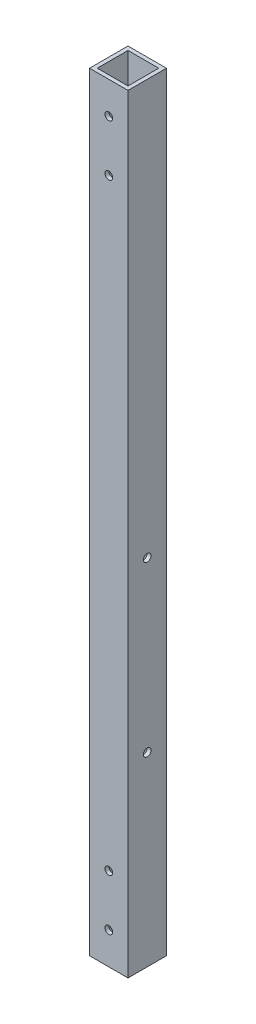
ISO-10303-21;
HEADER;
FILE_DESCRIPTION(('STEP AP214'),'2;1');
FILE_NAME('part.step','',(''),(''),'','','');
FILE_SCHEMA(('AUTOMOTIVE_DESIGN { 1 0 10303 214 1 1 1 1 }'));
ENDSEC;
DATA;
#1=APPLICATION_CONTEXT('core data for automotive mechanical design processes');
#2=APPLICATION_PROTOCOL_DEFINITION('international standard','automotive_design',2000,#1);
#3=PRODUCT_CONTEXT('',#1,'mechanical');
#4=PRODUCT('Part','Part','',(#3));
#5=PRODUCT_RELATED_PRODUCT_CATEGORY('part','',(#4));
#6=PRODUCT_DEFINITION_FORMATION('','',#4);
#7=PRODUCT_DEFINITION_CONTEXT('part definition',#1,'design');
#8=PRODUCT_DEFINITION('design','',#6,#7);
#9=PRODUCT_DEFINITION_SHAPE('','',#8);
#10=(LENGTH_UNIT() NAMED_UNIT(*) SI_UNIT(.MILLI.,.METRE.));
#11=(NAMED_UNIT(*) PLANE_ANGLE_UNIT() SI_UNIT($,.RADIAN.));
#12=(NAMED_UNIT(*) SI_UNIT($,.STERADIAN.) SOLID_ANGLE_UNIT());
#13=UNCERTAINTY_MEASURE_WITH_UNIT(LENGTH_MEASURE(1.E-05),#10,'distance_accuracy_value','');
#14=(GEOMETRIC_REPRESENTATION_CONTEXT(3) GLOBAL_UNCERTAINTY_ASSIGNED_CONTEXT((#13)) GLOBAL_UNIT_ASSIGNED_CONTEXT((#10,
#11,#12)) REPRESENTATION_CONTEXT('',''));
#15=CARTESIAN_POINT('',(0.,0.,0.));
#16=DIRECTION('',(0.,0.,1.));
#17=DIRECTION('',(1.,0.,0.));
#18=AXIS2_PLACEMENT_3D('',#15,#16,#17);
#19=CARTESIAN_POINT('',(0.,300.,0.));
#20=DIRECTION('',(0.,1.,0.));
#21=DIRECTION('',(0.,0.,1.));
#22=AXIS2_PLACEMENT_3D('',#19,#20,#21);
#23=PLANE('',#22);
#24=DIRECTION('',(0.,0.,1.));
#25=VECTOR('',#24,1.);
#26=CARTESIAN_POINT('',(0.,300.,0.));
#27=LINE('',#26,#25);
#28=CARTESIAN_POINT('',(0.,300.,-15.));
#29=VERTEX_POINT('',#28);
#30=CARTESIAN_POINT('',(0.,300.,0.));
#31=VERTEX_POINT('',#30);
#32=EDGE_CURVE('E170',#29,#31,#27,.T.);
#33=ORIENTED_EDGE('',*,*,#32,.T.);
#34=DIRECTION('',(1.,0.,0.));
#35=VECTOR('',#34,1.);
#36=CARTESIAN_POINT('',(0.,300.,0.));
#37=LINE('',#36,#35);
#38=CARTESIAN_POINT('',(15.,300.,0.));
#39=VERTEX_POINT('',#38);
#40=EDGE_CURVE('E173',#31,#39,#37,.T.);
#41=ORIENTED_EDGE('',*,*,#40,.T.);
#42=DIRECTION('',(0.,0.,-1.));
#43=VECTOR('',#42,1.);
#44=CARTESIAN_POINT('',(15.,300.,0.));
#45=LINE('',#44,#43);
#46=CARTESIAN_POINT('',(15.,300.,-15.));
#47=VERTEX_POINT('',#46);
#48=EDGE_CURVE('E176',#39,#47,#45,.T.);
#49=ORIENTED_EDGE('',*,*,#48,.T.);
#50=DIRECTION('',(-1.,0.,0.));
#51=VECTOR('',#50,1.);
#52=CARTESIAN_POINT('',(0.,300.,-15.));
#53=LINE('',#52,#51);
#54=EDGE_CURVE('E178',#47,#29,#53,.T.);
#55=ORIENTED_EDGE('',*,*,#54,.T.);
#56=EDGE_LOOP('',(#33,#41,#49,#55));
#57=FACE_BOUND('',#56,.T.);
#58=DIRECTION('',(1.,0.,0.));
#59=VECTOR('',#58,1.);
#60=CARTESIAN_POINT('',(0.,300.,-1.5));
#61=LINE('',#60,#59);
#62=CARTESIAN_POINT('',(1.5,300.,-1.5));
#63=VERTEX_POINT('',#62);
#64=CARTESIAN_POINT('',(13.5,300.,-1.5));
#65=VERTEX_POINT('',#64);
#66=EDGE_CURVE('E140',#63,#65,#61,.T.);
#67=ORIENTED_EDGE('',*,*,#66,.F.);
#68=DIRECTION('',(0.,0.,1.));
#69=VECTOR('',#68,1.);
#70=CARTESIAN_POINT('',(1.5,300.,0.));
#71=LINE('',#70,#69);
#72=CARTESIAN_POINT('',(1.5,300.,-13.5));
#73=VERTEX_POINT('',#72);
#74=EDGE_CURVE('E132',#73,#63,#71,.T.);
#75=ORIENTED_EDGE('',*,*,#74,.F.);
#76=DIRECTION('',(-1.,0.,0.));
#77=VECTOR('',#76,1.);
#78=CARTESIAN_POINT('',(0.,300.,-13.5));
#79=LINE('',#78,#77);
#80=CARTESIAN_POINT('',(13.5,300.,-13.5));
#81=VERTEX_POINT('',#80);
#82=EDGE_CURVE('E154',#81,#73,#79,.T.);
#83=ORIENTED_EDGE('',*,*,#82,.F.);
#84=DIRECTION('',(0.,0.,-1.));
#85=VECTOR('',#84,1.);
#86=CARTESIAN_POINT('',(13.5,300.,0.));
#87=LINE('',#86,#85);
#88=EDGE_CURVE('E152',#65,#81,#87,.T.);
#89=ORIENTED_EDGE('',*,*,#88,.F.);
#90=EDGE_LOOP('',(#67,#75,#83,#89));
#91=FACE_BOUND('',#90,.T.);
#92=ADVANCED_FACE('F65',(#57,#91),#23,.T.);
#93=CARTESIAN_POINT('',(0.,0.,0.));
#94=DIRECTION('',(0.,1.,0.));
#95=DIRECTION('',(0.,0.,1.));
#96=AXIS2_PLACEMENT_3D('',#93,#94,#95);
#97=PLANE('',#96);
#98=DIRECTION('',(0.,0.,1.));
#99=VECTOR('',#98,1.);
#100=CARTESIAN_POINT('',(0.,0.,0.));
#101=LINE('',#100,#99);
#102=CARTESIAN_POINT('',(0.,0.,-15.));
#103=VERTEX_POINT('',#102);
#104=CARTESIAN_POINT('',(0.,0.,0.));
#105=VERTEX_POINT('',#104);
#106=EDGE_CURVE('E148',#103,#105,#101,.T.);
#107=ORIENTED_EDGE('',*,*,#106,.F.);
#108=DIRECTION('',(-1.,0.,0.));
#109=VECTOR('',#108,1.);
#110=CARTESIAN_POINT('',(0.,0.,-15.));
#111=LINE('',#110,#109);
#112=CARTESIAN_POINT('',(15.,0.,-15.));
#113=VERTEX_POINT('',#112);
#114=EDGE_CURVE('E174',#113,#103,#111,.T.);
#115=ORIENTED_EDGE('',*,*,#114,.F.);
#116=DIRECTION('',(0.,0.,-1.));
#117=VECTOR('',#116,1.);
#118=CARTESIAN_POINT('',(15.,0.,0.));
#119=LINE('',#118,#117);
#120=CARTESIAN_POINT('',(15.,0.,0.));
#121=VERTEX_POINT('',#120);
#122=EDGE_CURVE('E185',#121,#113,#119,.T.);
#123=ORIENTED_EDGE('',*,*,#122,.F.);
#124=DIRECTION('',(1.,0.,0.));
#125=VECTOR('',#124,1.);
#126=CARTESIAN_POINT('',(0.,0.,0.));
#127=LINE('',#126,#125);
#128=EDGE_CURVE('E183',#105,#121,#127,.T.);
#129=ORIENTED_EDGE('',*,*,#128,.F.);
#130=EDGE_LOOP('',(#107,#115,#123,#129));
#131=FACE_BOUND('',#130,.T.);
#132=DIRECTION('',(0.,0.,1.));
#133=VECTOR('',#132,1.);
#134=CARTESIAN_POINT('',(1.5,0.,0.));
#135=LINE('',#134,#133);
#136=CARTESIAN_POINT('',(1.5,0.,-13.5));
#137=VERTEX_POINT('',#136);
#138=CARTESIAN_POINT('',(1.5,0.,-1.5));
#139=VERTEX_POINT('',#138);
#140=EDGE_CURVE('E90',#137,#139,#135,.T.);
#141=ORIENTED_EDGE('',*,*,#140,.T.);
#142=DIRECTION('',(1.,0.,0.));
#143=VECTOR('',#142,1.);
#144=CARTESIAN_POINT('',(0.,0.,-1.5));
#145=LINE('',#144,#143);
#146=CARTESIAN_POINT('',(13.5,0.,-1.5));
#147=VERTEX_POINT('',#146);
#148=EDGE_CURVE('E147',#139,#147,#145,.T.);
#149=ORIENTED_EDGE('',*,*,#148,.T.);
#150=DIRECTION('',(0.,0.,-1.));
#151=VECTOR('',#150,1.);
#152=CARTESIAN_POINT('',(13.5,0.,0.));
#153=LINE('',#152,#151);
#154=CARTESIAN_POINT('',(13.5,0.,-13.5));
#155=VERTEX_POINT('',#154);
#156=EDGE_CURVE('E162',#147,#155,#153,.T.);
#157=ORIENTED_EDGE('',*,*,#156,.T.);
#158=DIRECTION('',(-1.,0.,0.));
#159=VECTOR('',#158,1.);
#160=CARTESIAN_POINT('',(0.,0.,-13.5));
#161=LINE('',#160,#159);
#162=EDGE_CURVE('E141',#155,#137,#161,.T.);
#163=ORIENTED_EDGE('',*,*,#162,.T.);
#164=EDGE_LOOP('',(#141,#149,#157,#163));
#165=FACE_BOUND('',#164,.T.);
#166=ADVANCED_FACE('F302',(#131,#165),#97,.F.);
#167=CARTESIAN_POINT('',(0.,300.,0.));
#168=DIRECTION('',(1.,0.,0.));
#169=DIRECTION('',(0.,0.,-1.));
#170=AXIS2_PLACEMENT_3D('',#167,#168,#169);
#171=PLANE('',#170);
#172=CARTESIAN_POINT('',(0.,72.500000003919,-7.50000000000009));
#173=DIRECTION('',(-1.,0.,0.));
#174=DIRECTION('',(0.,0.,1.));
#175=AXIS2_PLACEMENT_3D('',#172,#173,#174);
#176=CIRCLE('',#175,1.5);
#177=CARTESIAN_POINT('',(0.,72.500000003919,-6.00000000000009));
#178=VERTEX_POINT('',#177);
#179=EDGE_CURVE('E219',#178,#178,#176,.T.);
#180=ORIENTED_EDGE('',*,*,#179,.F.);
#181=EDGE_LOOP('',(#180));
#182=FACE_BOUND('',#181,.T.);
#183=CARTESIAN_POINT('',(0.,138.290000003919,-7.50000000000009));
#184=DIRECTION('',(-1.,0.,0.));
#185=DIRECTION('',(0.,0.,1.));
#186=AXIS2_PLACEMENT_3D('',#183,#184,#185);
#187=CIRCLE('',#186,1.5);
#188=CARTESIAN_POINT('',(0.,138.290000003919,-6.00000000000009));
#189=VERTEX_POINT('',#188);
#190=EDGE_CURVE('E224',#189,#189,#187,.T.);
#191=ORIENTED_EDGE('',*,*,#190,.F.);
#192=EDGE_LOOP('',(#191));
#193=FACE_BOUND('',#192,.T.);
#194=ORIENTED_EDGE('',*,*,#106,.T.);
#195=DIRECTION('',(0.,-1.,0.));
#196=VECTOR('',#195,1.);
#197=CARTESIAN_POINT('',(0.,300.,0.));
#198=LINE('',#197,#196);
#199=EDGE_CURVE('E12',#31,#105,#198,.T.);
#200=ORIENTED_EDGE('',*,*,#199,.F.);
#201=ORIENTED_EDGE('',*,*,#32,.F.);
#202=DIRECTION('',(0.,-1.,0.));
#203=VECTOR('',#202,1.);
#204=CARTESIAN_POINT('',(0.,300.,-15.));
#205=LINE('',#204,#203);
#206=EDGE_CURVE('E180',#29,#103,#205,.T.);
#207=ORIENTED_EDGE('',*,*,#206,.T.);
#208=EDGE_LOOP('',(#194,#200,#201,#207));
#209=FACE_BOUND('',#208,.T.);
#210=ADVANCED_FACE('F67',(#182,#193,#209),#171,.F.);
#211=CARTESIAN_POINT('',(0.,300.,0.));
#212=DIRECTION('',(0.,0.,-1.));
#213=DIRECTION('',(-1.,0.,0.));
#214=AXIS2_PLACEMENT_3D('',#211,#212,#213);
#215=PLANE('',#214);
#216=CARTESIAN_POINT('',(7.49999999999823,12.4999999999982,0.));
#217=DIRECTION('',(0.,0.,1.));
#218=DIRECTION('',(1.,0.,0.));
#219=AXIS2_PLACEMENT_3D('',#216,#217,#218);
#220=CIRCLE('',#219,1.5);
#221=CARTESIAN_POINT('',(8.99999999999823,12.4999999999982,0.));
#222=VERTEX_POINT('',#221);
#223=EDGE_CURVE('E238',#222,#222,#220,.T.);
#224=ORIENTED_EDGE('',*,*,#223,.F.);
#225=EDGE_LOOP('',(#224));
#226=FACE_BOUND('',#225,.T.);
#227=CARTESIAN_POINT('',(7.49999999999823,32.4999999999982,0.));
#228=DIRECTION('',(0.,0.,1.));
#229=DIRECTION('',(1.,0.,0.));
#230=AXIS2_PLACEMENT_3D('',#227,#228,#229);
#231=CIRCLE('',#230,1.5);
#232=CARTESIAN_POINT('',(8.99999999999823,32.4999999999982,0.));
#233=VERTEX_POINT('',#232);
#234=EDGE_CURVE('E241',#233,#233,#231,.T.);
#235=ORIENTED_EDGE('',*,*,#234,.F.);
#236=EDGE_LOOP('',(#235));
#237=FACE_BOUND('',#236,.T.);
#238=CARTESIAN_POINT('',(7.49999999999998,267.5,0.));
#239=DIRECTION('',(0.,0.,1.));
#240=DIRECTION('',(1.,0.,0.));
#241=AXIS2_PLACEMENT_3D('',#238,#239,#240);
#242=CIRCLE('',#241,1.5);
#243=CARTESIAN_POINT('',(8.99999999999998,267.5,0.));
#244=VERTEX_POINT('',#243);
#245=EDGE_CURVE('E247',#244,#244,#242,.T.);
#246=ORIENTED_EDGE('',*,*,#245,.F.);
#247=EDGE_LOOP('',(#246));
#248=FACE_BOUND('',#247,.T.);
#249=CARTESIAN_POINT('',(7.49999999999998,287.5,0.));
#250=DIRECTION('',(0.,0.,1.));
#251=DIRECTION('',(1.,0.,0.));
#252=AXIS2_PLACEMENT_3D('',#249,#250,#251);
#253=CIRCLE('',#252,1.5);
#254=CARTESIAN_POINT('',(8.99999999999998,287.5,0.));
#255=VERTEX_POINT('',#254);
#256=EDGE_CURVE('E253',#255,#255,#253,.T.);
#257=ORIENTED_EDGE('',*,*,#256,.F.);
#258=EDGE_LOOP('',(#257));
#259=FACE_BOUND('',#258,.T.);
#260=ORIENTED_EDGE('',*,*,#128,.T.);
#261=DIRECTION('',(0.,-1.,0.));
#262=VECTOR('',#261,1.);
#263=CARTESIAN_POINT('',(15.,300.,0.));
#264=LINE('',#263,#262);
#265=EDGE_CURVE('E74',#39,#121,#264,.T.);
#266=ORIENTED_EDGE('',*,*,#265,.F.);
#267=ORIENTED_EDGE('',*,*,#40,.F.);
#268=ORIENTED_EDGE('',*,*,#199,.T.);
#269=EDGE_LOOP('',(#260,#266,#267,#268));
#270=FACE_BOUND('',#269,.T.);
#271=ADVANCED_FACE('F288',(#226,#237,#248,#259,#270),#215,.F.);
#272=CARTESIAN_POINT('',(15.,300.,0.));
#273=DIRECTION('',(-1.,0.,0.));
#274=DIRECTION('',(0.,0.,1.));
#275=AXIS2_PLACEMENT_3D('',#272,#273,#274);
#276=PLANE('',#275);
#277=CARTESIAN_POINT('',(15.,72.500000003919,-7.50000000000009));
#278=DIRECTION('',(-1.,0.,0.));
#279=DIRECTION('',(0.,0.,1.));
#280=AXIS2_PLACEMENT_3D('',#277,#278,#279);
#281=CIRCLE('',#280,1.5);
#282=CARTESIAN_POINT('',(15.,72.500000003919,-6.00000000000009));
#283=VERTEX_POINT('',#282);
#284=EDGE_CURVE('E213',#283,#283,#281,.T.);
#285=ORIENTED_EDGE('',*,*,#284,.T.);
#286=EDGE_LOOP('',(#285));
#287=FACE_BOUND('',#286,.T.);
#288=CARTESIAN_POINT('',(15.,138.290000003919,-7.50000000000009));
#289=DIRECTION('',(-1.,0.,0.));
#290=DIRECTION('',(0.,0.,1.));
#291=AXIS2_PLACEMENT_3D('',#288,#289,#290);
#292=CIRCLE('',#291,1.5);
#293=CARTESIAN_POINT('',(15.,138.290000003919,-6.00000000000009));
#294=VERTEX_POINT('',#293);
#295=EDGE_CURVE('E229',#294,#294,#292,.T.);
#296=ORIENTED_EDGE('',*,*,#295,.T.);
#297=EDGE_LOOP('',(#296));
#298=FACE_BOUND('',#297,.T.);
#299=ORIENTED_EDGE('',*,*,#122,.T.);
#300=DIRECTION('',(0.,-1.,0.));
#301=VECTOR('',#300,1.);
#302=CARTESIAN_POINT('',(15.,300.,-15.));
#303=LINE('',#302,#301);
#304=EDGE_CURVE('E190',#47,#113,#303,.T.);
#305=ORIENTED_EDGE('',*,*,#304,.F.);
#306=ORIENTED_EDGE('',*,*,#48,.F.);
#307=ORIENTED_EDGE('',*,*,#265,.T.);
#308=EDGE_LOOP('',(#299,#305,#306,#307));
#309=FACE_BOUND('',#308,.T.);
#310=ADVANCED_FACE('F291',(#287,#298,#309),#276,.F.);
#311=CARTESIAN_POINT('',(0.,300.,-15.));
#312=DIRECTION('',(0.,0.,1.));
#313=DIRECTION('',(1.,0.,0.));
#314=AXIS2_PLACEMENT_3D('',#311,#312,#313);
#315=PLANE('',#314);
#316=CARTESIAN_POINT('',(7.49999999999823,12.4999999999982,-15.));
#317=DIRECTION('',(0.,0.,1.));
#318=DIRECTION('',(1.,0.,0.));
#319=AXIS2_PLACEMENT_3D('',#316,#317,#318);
#320=CIRCLE('',#319,1.5);
#321=CARTESIAN_POINT('',(8.99999999999823,12.4999999999982,-15.));
#322=VERTEX_POINT('',#321);
#323=EDGE_CURVE('E199',#322,#322,#320,.T.);
#324=ORIENTED_EDGE('',*,*,#323,.T.);
#325=EDGE_LOOP('',(#324));
#326=FACE_BOUND('',#325,.T.);
#327=CARTESIAN_POINT('',(7.49999999999823,32.4999999999982,-15.));
#328=DIRECTION('',(0.,0.,1.));
#329=DIRECTION('',(1.,0.,0.));
#330=AXIS2_PLACEMENT_3D('',#327,#328,#329);
#331=CIRCLE('',#330,1.5);
#332=CARTESIAN_POINT('',(8.99999999999823,32.4999999999982,-15.));
#333=VERTEX_POINT('',#332);
#334=EDGE_CURVE('E244',#333,#333,#331,.T.);
#335=ORIENTED_EDGE('',*,*,#334,.T.);
#336=EDGE_LOOP('',(#335));
#337=FACE_BOUND('',#336,.T.);
#338=CARTESIAN_POINT('',(7.49999999999998,267.5,-15.));
#339=DIRECTION('',(0.,0.,1.));
#340=DIRECTION('',(1.,0.,0.));
#341=AXIS2_PLACEMENT_3D('',#338,#339,#340);
#342=CIRCLE('',#341,1.5);
#343=CARTESIAN_POINT('',(8.99999999999998,267.5,-15.));
#344=VERTEX_POINT('',#343);
#345=EDGE_CURVE('E250',#344,#344,#342,.T.);
#346=ORIENTED_EDGE('',*,*,#345,.T.);
#347=EDGE_LOOP('',(#346));
#348=FACE_BOUND('',#347,.T.);
#349=CARTESIAN_POINT('',(7.49999999999998,287.5,-15.));
#350=DIRECTION('',(0.,0.,1.));
#351=DIRECTION('',(1.,0.,0.));
#352=AXIS2_PLACEMENT_3D('',#349,#350,#351);
#353=CIRCLE('',#352,1.5);
#354=CARTESIAN_POINT('',(8.99999999999998,287.5,-15.));
#355=VERTEX_POINT('',#354);
#356=EDGE_CURVE('E235',#355,#355,#353,.T.);
#357=ORIENTED_EDGE('',*,*,#356,.T.);
#358=EDGE_LOOP('',(#357));
#359=FACE_BOUND('',#358,.T.);
#360=ORIENTED_EDGE('',*,*,#114,.T.);
#361=ORIENTED_EDGE('',*,*,#206,.F.);
#362=ORIENTED_EDGE('',*,*,#54,.F.);
#363=ORIENTED_EDGE('',*,*,#304,.T.);
#364=EDGE_LOOP('',(#360,#361,#362,#363));
#365=FACE_BOUND('',#364,.T.);
#366=ADVANCED_FACE('F306',(#326,#337,#348,#359,#365),#315,.F.);
#367=CARTESIAN_POINT('',(1.5,300.,0.));
#368=DIRECTION('',(1.,0.,0.));
#369=DIRECTION('',(0.,0.,-1.));
#370=AXIS2_PLACEMENT_3D('',#367,#368,#369);
#371=PLANE('',#370);
#372=CARTESIAN_POINT('',(1.5,72.500000003919,-7.50000000000009));
#373=DIRECTION('',(1.,0.,0.));
#374=DIRECTION('',(0.,0.,-1.));
#375=AXIS2_PLACEMENT_3D('',#372,#373,#374);
#376=CIRCLE('',#375,1.5);
#377=CARTESIAN_POINT('',(1.5,72.500000003919,-9.00000000000009));
#378=VERTEX_POINT('',#377);
#379=EDGE_CURVE('E232',#378,#378,#376,.T.);
#380=ORIENTED_EDGE('',*,*,#379,.F.);
#381=EDGE_LOOP('',(#380));
#382=FACE_BOUND('',#381,.T.);
#383=CARTESIAN_POINT('',(1.5,138.290000003919,-7.50000000000009));
#384=DIRECTION('',(1.,0.,0.));
#385=DIRECTION('',(0.,0.,-1.));
#386=AXIS2_PLACEMENT_3D('',#383,#384,#385);
#387=CIRCLE('',#386,1.5);
#388=CARTESIAN_POINT('',(1.5,138.290000003919,-9.00000000000009));
#389=VERTEX_POINT('',#388);
#390=EDGE_CURVE('E212',#389,#389,#387,.T.);
#391=ORIENTED_EDGE('',*,*,#390,.F.);
#392=EDGE_LOOP('',(#391));
#393=FACE_BOUND('',#392,.T.);
#394=ORIENTED_EDGE('',*,*,#140,.F.);
#395=DIRECTION('',(0.,-1.,0.));
#396=VECTOR('',#395,1.);
#397=CARTESIAN_POINT('',(1.5,300.,-13.5));
#398=LINE('',#397,#396);
#399=EDGE_CURVE('E136',#73,#137,#398,.T.);
#400=ORIENTED_EDGE('',*,*,#399,.F.);
#401=ORIENTED_EDGE('',*,*,#74,.T.);
#402=DIRECTION('',(0.,-1.,0.));
#403=VECTOR('',#402,1.);
#404=CARTESIAN_POINT('',(1.5,300.,-1.5));
#405=LINE('',#404,#403);
#406=EDGE_CURVE('E135',#63,#139,#405,.T.);
#407=ORIENTED_EDGE('',*,*,#406,.T.);
#408=EDGE_LOOP('',(#394,#400,#401,#407));
#409=FACE_BOUND('',#408,.T.);
#410=ADVANCED_FACE('F134',(#382,#393,#409),#371,.T.);
#411=CARTESIAN_POINT('',(0.,300.,-1.5));
#412=DIRECTION('',(0.,0.,-1.));
#413=DIRECTION('',(-1.,0.,0.));
#414=AXIS2_PLACEMENT_3D('',#411,#412,#413);
#415=PLANE('',#414);
#416=CARTESIAN_POINT('',(7.49999999999823,12.4999999999982,-1.5));
#417=DIRECTION('',(0.,0.,-1.));
#418=DIRECTION('',(-1.,0.,0.));
#419=AXIS2_PLACEMENT_3D('',#416,#417,#418);
#420=CIRCLE('',#419,1.5);
#421=CARTESIAN_POINT('',(5.99999999999823,12.4999999999982,-1.5));
#422=VERTEX_POINT('',#421);
#423=EDGE_CURVE('E160',#422,#422,#420,.T.);
#424=ORIENTED_EDGE('',*,*,#423,.F.);
#425=EDGE_LOOP('',(#424));
#426=FACE_BOUND('',#425,.T.);
#427=CARTESIAN_POINT('',(7.49999999999823,32.4999999999982,-1.5));
#428=DIRECTION('',(0.,0.,-1.));
#429=DIRECTION('',(-1.,0.,0.));
#430=AXIS2_PLACEMENT_3D('',#427,#428,#429);
#431=CIRCLE('',#430,1.5);
#432=CARTESIAN_POINT('',(5.99999999999823,32.4999999999982,-1.5));
#433=VERTEX_POINT('',#432);
#434=EDGE_CURVE('E207',#433,#433,#431,.T.);
#435=ORIENTED_EDGE('',*,*,#434,.F.);
#436=EDGE_LOOP('',(#435));
#437=FACE_BOUND('',#436,.T.);
#438=CARTESIAN_POINT('',(7.49999999999998,267.5,-1.5));
#439=DIRECTION('',(0.,0.,-1.));
#440=DIRECTION('',(-1.,0.,0.));
#441=AXIS2_PLACEMENT_3D('',#438,#439,#440);
#442=CIRCLE('',#441,1.5);
#443=CARTESIAN_POINT('',(5.99999999999998,267.5,-1.5));
#444=VERTEX_POINT('',#443);
#445=EDGE_CURVE('E203',#444,#444,#442,.T.);
#446=ORIENTED_EDGE('',*,*,#445,.F.);
#447=EDGE_LOOP('',(#446));
#448=FACE_BOUND('',#447,.T.);
#449=CARTESIAN_POINT('',(7.49999999999998,287.5,-1.5));
#450=DIRECTION('',(0.,0.,-1.));
#451=DIRECTION('',(-1.,0.,0.));
#452=AXIS2_PLACEMENT_3D('',#449,#450,#451);
#453=CIRCLE('',#452,1.5);
#454=CARTESIAN_POINT('',(5.99999999999998,287.5,-1.5));
#455=VERTEX_POINT('',#454);
#456=EDGE_CURVE('E198',#455,#455,#453,.T.);
#457=ORIENTED_EDGE('',*,*,#456,.F.);
#458=EDGE_LOOP('',(#457));
#459=FACE_BOUND('',#458,.T.);
#460=ORIENTED_EDGE('',*,*,#148,.F.);
#461=ORIENTED_EDGE('',*,*,#406,.F.);
#462=ORIENTED_EDGE('',*,*,#66,.T.);
#463=DIRECTION('',(0.,-1.,0.));
#464=VECTOR('',#463,1.);
#465=CARTESIAN_POINT('',(13.5,300.,-1.5));
#466=LINE('',#465,#464);
#467=EDGE_CURVE('E149',#65,#147,#466,.T.);
#468=ORIENTED_EDGE('',*,*,#467,.T.);
#469=EDGE_LOOP('',(#460,#461,#462,#468));
#470=FACE_BOUND('',#469,.T.);
#471=ADVANCED_FACE('F144',(#426,#437,#448,#459,#470),#415,.T.);
#472=CARTESIAN_POINT('',(13.5,300.,0.));
#473=DIRECTION('',(-1.,0.,0.));
#474=DIRECTION('',(0.,0.,1.));
#475=AXIS2_PLACEMENT_3D('',#472,#473,#474);
#476=PLANE('',#475);
#477=CARTESIAN_POINT('',(13.5,72.500000003919,-7.50000000000009));
#478=DIRECTION('',(-1.,0.,0.));
#479=DIRECTION('',(0.,0.,1.));
#480=AXIS2_PLACEMENT_3D('',#477,#478,#479);
#481=CIRCLE('',#480,1.5);
#482=CARTESIAN_POINT('',(13.5,72.500000003919,-6.00000000000009));
#483=VERTEX_POINT('',#482);
#484=EDGE_CURVE('E69',#483,#483,#481,.T.);
#485=ORIENTED_EDGE('',*,*,#484,.F.);
#486=EDGE_LOOP('',(#485));
#487=FACE_BOUND('',#486,.T.);
#488=CARTESIAN_POINT('',(13.5,138.290000003919,-7.50000000000009));
#489=DIRECTION('',(-1.,0.,0.));
#490=DIRECTION('',(0.,0.,1.));
#491=AXIS2_PLACEMENT_3D('',#488,#489,#490);
#492=CIRCLE('',#491,1.5);
#493=CARTESIAN_POINT('',(13.5,138.290000003919,-6.00000000000009));
#494=VERTEX_POINT('',#493);
#495=EDGE_CURVE('E210',#494,#494,#492,.T.);
#496=ORIENTED_EDGE('',*,*,#495,.F.);
#497=EDGE_LOOP('',(#496));
#498=FACE_BOUND('',#497,.T.);
#499=ORIENTED_EDGE('',*,*,#156,.F.);
#500=ORIENTED_EDGE('',*,*,#467,.F.);
#501=ORIENTED_EDGE('',*,*,#88,.T.);
#502=DIRECTION('',(0.,-1.,0.));
#503=VECTOR('',#502,1.);
#504=CARTESIAN_POINT('',(13.5,300.,-13.5));
#505=LINE('',#504,#503);
#506=EDGE_CURVE('E82',#81,#155,#505,.T.);
#507=ORIENTED_EDGE('',*,*,#506,.T.);
#508=EDGE_LOOP('',(#499,#500,#501,#507));
#509=FACE_BOUND('',#508,.T.);
#510=ADVANCED_FACE('F271',(#487,#498,#509),#476,.T.);
#511=CARTESIAN_POINT('',(0.,300.,-13.5));
#512=DIRECTION('',(0.,0.,1.));
#513=DIRECTION('',(1.,0.,0.));
#514=AXIS2_PLACEMENT_3D('',#511,#512,#513);
#515=PLANE('',#514);
#516=CARTESIAN_POINT('',(7.49999999999823,12.4999999999982,-13.5));
#517=DIRECTION('',(0.,0.,1.));
#518=DIRECTION('',(1.,0.,0.));
#519=AXIS2_PLACEMENT_3D('',#516,#517,#518);
#520=CIRCLE('',#519,1.5);
#521=CARTESIAN_POINT('',(8.99999999999823,12.4999999999982,-13.5));
#522=VERTEX_POINT('',#521);
#523=EDGE_CURVE('E208',#522,#522,#520,.T.);
#524=ORIENTED_EDGE('',*,*,#523,.F.);
#525=EDGE_LOOP('',(#524));
#526=FACE_BOUND('',#525,.T.);
#527=CARTESIAN_POINT('',(7.49999999999823,32.4999999999982,-13.5));
#528=DIRECTION('',(0.,0.,1.));
#529=DIRECTION('',(1.,0.,0.));
#530=AXIS2_PLACEMENT_3D('',#527,#528,#529);
#531=CIRCLE('',#530,1.5);
#532=CARTESIAN_POINT('',(8.99999999999823,32.4999999999982,-13.5));
#533=VERTEX_POINT('',#532);
#534=EDGE_CURVE('E204',#533,#533,#531,.T.);
#535=ORIENTED_EDGE('',*,*,#534,.F.);
#536=EDGE_LOOP('',(#535));
#537=FACE_BOUND('',#536,.T.);
#538=CARTESIAN_POINT('',(7.49999999999998,267.5,-13.5));
#539=DIRECTION('',(0.,0.,1.));
#540=DIRECTION('',(1.,0.,0.));
#541=AXIS2_PLACEMENT_3D('',#538,#539,#540);
#542=CIRCLE('',#541,1.5);
#543=CARTESIAN_POINT('',(8.99999999999998,267.5,-13.5));
#544=VERTEX_POINT('',#543);
#545=EDGE_CURVE('E200',#544,#544,#542,.T.);
#546=ORIENTED_EDGE('',*,*,#545,.F.);
#547=EDGE_LOOP('',(#546));
#548=FACE_BOUND('',#547,.T.);
#549=CARTESIAN_POINT('',(7.49999999999998,287.5,-13.5));
#550=DIRECTION('',(0.,0.,1.));
#551=DIRECTION('',(1.,0.,0.));
#552=AXIS2_PLACEMENT_3D('',#549,#550,#551);
#553=CIRCLE('',#552,1.5);
#554=CARTESIAN_POINT('',(8.99999999999998,287.5,-13.5));
#555=VERTEX_POINT('',#554);
#556=EDGE_CURVE('E195',#555,#555,#553,.T.);
#557=ORIENTED_EDGE('',*,*,#556,.F.);
#558=EDGE_LOOP('',(#557));
#559=FACE_BOUND('',#558,.T.);
#560=ORIENTED_EDGE('',*,*,#162,.F.);
#561=ORIENTED_EDGE('',*,*,#506,.F.);
#562=ORIENTED_EDGE('',*,*,#82,.T.);
#563=ORIENTED_EDGE('',*,*,#399,.T.);
#564=EDGE_LOOP('',(#560,#561,#562,#563));
#565=FACE_BOUND('',#564,.T.);
#566=ADVANCED_FACE('F418',(#526,#537,#548,#559,#565),#515,.T.);
#567=CARTESIAN_POINT('',(7.49999999999998,287.5,-15.));
#568=DIRECTION('',(0.,0.,1.));
#569=DIRECTION('',(1.,0.,0.));
#570=AXIS2_PLACEMENT_3D('',#567,#568,#569);
#571=CYLINDRICAL_SURFACE('',#570,1.5);
#572=ORIENTED_EDGE('',*,*,#556,.T.);
#573=EDGE_LOOP('',(#572));
#574=FACE_BOUND('',#573,.T.);
#575=ORIENTED_EDGE('',*,*,#356,.F.);
#576=EDGE_LOOP('',(#575));
#577=FACE_BOUND('',#576,.T.);
#578=ADVANCED_FACE('F285',(#574,#577),#571,.F.);
#579=CARTESIAN_POINT('',(7.49999999999998,267.5,-15.));
#580=DIRECTION('',(0.,0.,1.));
#581=DIRECTION('',(1.,0.,0.));
#582=AXIS2_PLACEMENT_3D('',#579,#580,#581);
#583=CYLINDRICAL_SURFACE('',#582,1.5);
#584=ORIENTED_EDGE('',*,*,#545,.T.);
#585=EDGE_LOOP('',(#584));
#586=FACE_BOUND('',#585,.T.);
#587=ORIENTED_EDGE('',*,*,#345,.F.);
#588=EDGE_LOOP('',(#587));
#589=FACE_BOUND('',#588,.T.);
#590=ADVANCED_FACE('F384',(#586,#589),#583,.F.);
#591=CARTESIAN_POINT('',(7.49999999999823,32.4999999999982,-15.));
#592=DIRECTION('',(0.,0.,1.));
#593=DIRECTION('',(1.,0.,0.));
#594=AXIS2_PLACEMENT_3D('',#591,#592,#593);
#595=CYLINDRICAL_SURFACE('',#594,1.5);
#596=ORIENTED_EDGE('',*,*,#534,.T.);
#597=EDGE_LOOP('',(#596));
#598=FACE_BOUND('',#597,.T.);
#599=ORIENTED_EDGE('',*,*,#334,.F.);
#600=EDGE_LOOP('',(#599));
#601=FACE_BOUND('',#600,.T.);
#602=ADVANCED_FACE('F376',(#598,#601),#595,.F.);
#603=CARTESIAN_POINT('',(7.49999999999823,12.4999999999982,-15.));
#604=DIRECTION('',(0.,0.,1.));
#605=DIRECTION('',(1.,0.,0.));
#606=AXIS2_PLACEMENT_3D('',#603,#604,#605);
#607=CYLINDRICAL_SURFACE('',#606,1.5);
#608=ORIENTED_EDGE('',*,*,#523,.T.);
#609=EDGE_LOOP('',(#608));
#610=FACE_BOUND('',#609,.T.);
#611=ORIENTED_EDGE('',*,*,#323,.F.);
#612=EDGE_LOOP('',(#611));
#613=FACE_BOUND('',#612,.T.);
#614=ADVANCED_FACE('F283',(#610,#613),#607,.F.);
#615=ORIENTED_EDGE('',*,*,#456,.T.);
#616=EDGE_LOOP('',(#615));
#617=FACE_BOUND('',#616,.T.);
#618=ORIENTED_EDGE('',*,*,#256,.T.);
#619=EDGE_LOOP('',(#618));
#620=FACE_BOUND('',#619,.T.);
#621=ADVANCED_FACE('F279',(#617,#620),#571,.F.);
#622=ORIENTED_EDGE('',*,*,#445,.T.);
#623=EDGE_LOOP('',(#622));
#624=FACE_BOUND('',#623,.T.);
#625=ORIENTED_EDGE('',*,*,#245,.T.);
#626=EDGE_LOOP('',(#625));
#627=FACE_BOUND('',#626,.T.);
#628=ADVANCED_FACE('F282',(#624,#627),#583,.F.);
#629=ORIENTED_EDGE('',*,*,#434,.T.);
#630=EDGE_LOOP('',(#629));
#631=FACE_BOUND('',#630,.T.);
#632=ORIENTED_EDGE('',*,*,#234,.T.);
#633=EDGE_LOOP('',(#632));
#634=FACE_BOUND('',#633,.T.);
#635=ADVANCED_FACE('F343',(#631,#634),#595,.F.);
#636=ORIENTED_EDGE('',*,*,#423,.T.);
#637=EDGE_LOOP('',(#636));
#638=FACE_BOUND('',#637,.T.);
#639=ORIENTED_EDGE('',*,*,#223,.T.);
#640=EDGE_LOOP('',(#639));
#641=FACE_BOUND('',#640,.T.);
#642=ADVANCED_FACE('F266',(#638,#641),#607,.F.);
#643=CARTESIAN_POINT('',(15.,138.290000003919,-7.50000000000009));
#644=DIRECTION('',(-1.,0.,0.));
#645=DIRECTION('',(0.,0.,1.));
#646=AXIS2_PLACEMENT_3D('',#643,#644,#645);
#647=CYLINDRICAL_SURFACE('',#646,1.5);
#648=ORIENTED_EDGE('',*,*,#495,.T.);
#649=EDGE_LOOP('',(#648));
#650=FACE_BOUND('',#649,.T.);
#651=ORIENTED_EDGE('',*,*,#295,.F.);
#652=EDGE_LOOP('',(#651));
#653=FACE_BOUND('',#652,.T.);
#654=ADVANCED_FACE('F330',(#650,#653),#647,.F.);
#655=CARTESIAN_POINT('',(15.,72.500000003919,-7.50000000000009));
#656=DIRECTION('',(-1.,0.,0.));
#657=DIRECTION('',(0.,0.,1.));
#658=AXIS2_PLACEMENT_3D('',#655,#656,#657);
#659=CYLINDRICAL_SURFACE('',#658,1.5);
#660=ORIENTED_EDGE('',*,*,#484,.T.);
#661=EDGE_LOOP('',(#660));
#662=FACE_BOUND('',#661,.T.);
#663=ORIENTED_EDGE('',*,*,#284,.F.);
#664=EDGE_LOOP('',(#663));
#665=FACE_BOUND('',#664,.T.);
#666=ADVANCED_FACE('F332',(#662,#665),#659,.F.);
#667=ORIENTED_EDGE('',*,*,#390,.T.);
#668=EDGE_LOOP('',(#667));
#669=FACE_BOUND('',#668,.T.);
#670=ORIENTED_EDGE('',*,*,#190,.T.);
#671=EDGE_LOOP('',(#670));
#672=FACE_BOUND('',#671,.T.);
#673=ADVANCED_FACE('F334',(#669,#672),#647,.F.);
#674=ORIENTED_EDGE('',*,*,#379,.T.);
#675=EDGE_LOOP('',(#674));
#676=FACE_BOUND('',#675,.T.);
#677=ORIENTED_EDGE('',*,*,#179,.T.);
#678=EDGE_LOOP('',(#677));
#679=FACE_BOUND('',#678,.T.);
#680=ADVANCED_FACE('F341',(#676,#679),#659,.F.);
#681=CLOSED_SHELL('',(#92,#166,#210,#271,#310,#366,#410,#471,#510,#566,#578,#590,#602,#614,#621,
#628,#635,#642,#654,#666,#673,#680));
#682=MANIFOLD_SOLID_BREP('B2',#681);
#683=ADVANCED_BREP_SHAPE_REPRESENTATION('',(#18,#682),#14);
#684=SHAPE_DEFINITION_REPRESENTATION(#9,#683);
ENDSEC;
END-ISO-10303-21;
